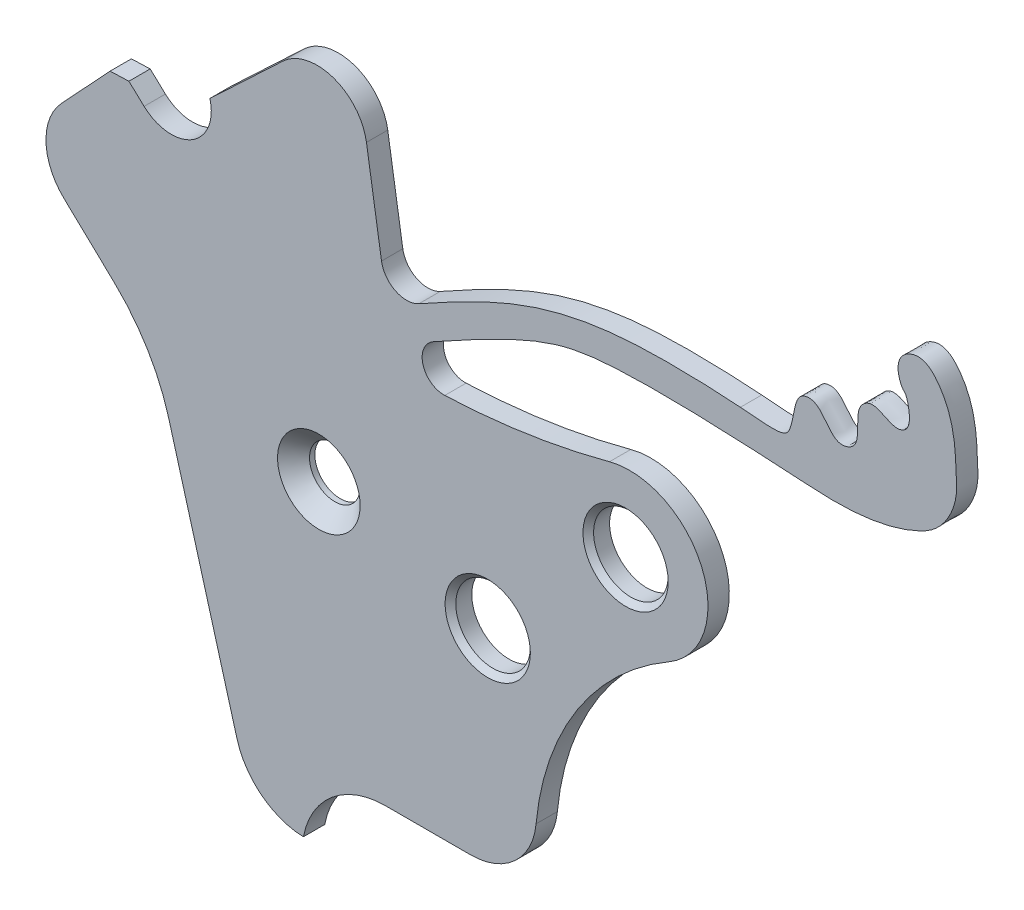
ISO-10303-21;
HEADER;
FILE_DESCRIPTION(('STEP AP214'),'2;1');
FILE_NAME('part.step','',(''),(''),'','','');
FILE_SCHEMA(('AUTOMOTIVE_DESIGN { 1 0 10303 214 1 1 1 1 }'));
ENDSEC;
DATA;
#1=APPLICATION_CONTEXT('core data for automotive mechanical design processes');
#2=APPLICATION_PROTOCOL_DEFINITION('international standard','automotive_design',2000,#1);
#3=PRODUCT_CONTEXT('',#1,'mechanical');
#4=PRODUCT('Part','Part','',(#3));
#5=PRODUCT_RELATED_PRODUCT_CATEGORY('part','',(#4));
#6=PRODUCT_DEFINITION_FORMATION('','',#4);
#7=PRODUCT_DEFINITION_CONTEXT('part definition',#1,'design');
#8=PRODUCT_DEFINITION('design','',#6,#7);
#9=PRODUCT_DEFINITION_SHAPE('','',#8);
#10=(LENGTH_UNIT() NAMED_UNIT(*) SI_UNIT(.MILLI.,.METRE.));
#11=(NAMED_UNIT(*) PLANE_ANGLE_UNIT() SI_UNIT($,.RADIAN.));
#12=(NAMED_UNIT(*) SI_UNIT($,.STERADIAN.) SOLID_ANGLE_UNIT());
#13=UNCERTAINTY_MEASURE_WITH_UNIT(LENGTH_MEASURE(1.E-05),#10,'distance_accuracy_value','');
#14=(GEOMETRIC_REPRESENTATION_CONTEXT(3) GLOBAL_UNCERTAINTY_ASSIGNED_CONTEXT((#13)) GLOBAL_UNIT_ASSIGNED_CONTEXT((#10,
#11,#12)) REPRESENTATION_CONTEXT('',''));
#15=CARTESIAN_POINT('',(0.,0.,0.));
#16=DIRECTION('',(0.,0.,1.));
#17=DIRECTION('',(1.,0.,0.));
#18=AXIS2_PLACEMENT_3D('',#15,#16,#17);
#19=CARTESIAN_POINT('',(-2.76936208659466,5.01169202146616,0.4));
#20=DIRECTION('',(0.,0.,-1.));
#21=DIRECTION('',(-1.,0.,0.));
#22=AXIS2_PLACEMENT_3D('',#19,#20,#21);
#23=CYLINDRICAL_SURFACE('',#22,0.750000000000002);
#24=CARTESIAN_POINT('',(-2.76936208659466,5.01169202146616,0.));
#25=DIRECTION('',(0.,0.,-1.));
#26=DIRECTION('',(1.,0.,0.));
#27=AXIS2_PLACEMENT_3D('',#24,#25,#26);
#28=CIRCLE('',#27,0.750000000000002);
#29=CARTESIAN_POINT('',(-2.04568324482414,5.20864108588045,0.));
#30=VERTEX_POINT('',#29);
#31=CARTESIAN_POINT('',(-3.28039810312994,4.46274558527792,0.));
#32=VERTEX_POINT('',#31);
#33=EDGE_CURVE('E223',#30,#32,#28,.T.);
#34=ORIENTED_EDGE('',*,*,#33,.T.);
#35=DIRECTION('',(0.,0.,-1.));
#36=VECTOR('',#35,1.);
#37=CARTESIAN_POINT('',(-3.28039810312994,4.46274558527792,0.4));
#38=LINE('',#37,#36);
#39=CARTESIAN_POINT('',(-3.28039810312994,4.46274558527792,0.4));
#40=VERTEX_POINT('',#39);
#41=EDGE_CURVE('E341',#40,#32,#38,.T.);
#42=ORIENTED_EDGE('',*,*,#41,.F.);
#43=CARTESIAN_POINT('',(-2.76936208659466,5.01169202146616,0.4));
#44=DIRECTION('',(0.,0.,-1.));
#45=DIRECTION('',(1.,0.,0.));
#46=AXIS2_PLACEMENT_3D('',#43,#44,#45);
#47=CIRCLE('',#46,0.750000000000002);
#48=CARTESIAN_POINT('',(-2.04568324482414,5.20864108588045,0.4));
#49=VERTEX_POINT('',#48);
#50=EDGE_CURVE('E283',#49,#40,#47,.T.);
#51=ORIENTED_EDGE('',*,*,#50,.F.);
#52=DIRECTION('',(0.,0.,-1.));
#53=VECTOR('',#52,1.);
#54=CARTESIAN_POINT('',(-2.04568324482414,5.20864108588045,0.4));
#55=LINE('',#54,#53);
#56=EDGE_CURVE('E219',#49,#30,#55,.T.);
#57=ORIENTED_EDGE('',*,*,#56,.T.);
#58=EDGE_LOOP('',(#34,#42,#51,#57));
#59=FACE_BOUND('',#58,.T.);
#60=ADVANCED_FACE('F35',(#59),#23,.F.);
#61=CARTESIAN_POINT('',(-3.28039810312994,4.46274558527792,0.4));
#62=DIRECTION('',(-0.681381355380353,-0.731928581584319,0.));
#63=DIRECTION('',(0.731928581584319,-0.681381355380353,0.));
#64=AXIS2_PLACEMENT_3D('',#61,#62,#63);
#65=PLANE('',#64);
#66=DIRECTION('',(-0.731928581584319,0.681381355380353,0.));
#67=VECTOR('',#66,1.);
#68=CARTESIAN_POINT('',(-3.28039810312994,4.46274558527792,0.));
#69=LINE('',#68,#67);
#70=CARTESIAN_POINT('',(-3.56599042337214,4.72861480687825,0.));
#71=VERTEX_POINT('',#70);
#72=EDGE_CURVE('E226',#32,#71,#69,.T.);
#73=ORIENTED_EDGE('',*,*,#72,.T.);
#74=DIRECTION('',(0.,0.,-1.));
#75=VECTOR('',#74,1.);
#76=CARTESIAN_POINT('',(-3.56599042337214,4.72861480687825,0.4));
#77=LINE('',#76,#75);
#78=CARTESIAN_POINT('',(-3.56599042337214,4.72861480687825,0.4));
#79=VERTEX_POINT('',#78);
#80=EDGE_CURVE('E338',#79,#71,#77,.T.);
#81=ORIENTED_EDGE('',*,*,#80,.F.);
#82=DIRECTION('',(-0.731928581584319,0.681381355380353,0.));
#83=VECTOR('',#82,1.);
#84=CARTESIAN_POINT('',(-3.28039810312994,4.46274558527792,0.4));
#85=LINE('',#84,#83);
#86=EDGE_CURVE('E141',#40,#79,#85,.T.);
#87=ORIENTED_EDGE('',*,*,#86,.F.);
#88=ORIENTED_EDGE('',*,*,#41,.T.);
#89=EDGE_LOOP('',(#73,#81,#87,#88));
#90=FACE_BOUND('',#89,.T.);
#91=ADVANCED_FACE('F487',(#90),#65,.F.);
#92=CARTESIAN_POINT('',(-3.56599042337214,4.72861480687825,0.4));
#93=DIRECTION('',(0.0357422864189901,-0.999361040346052,0.));
#94=DIRECTION('',(0.999361040346052,0.0357422864189901,0.));
#95=AXIS2_PLACEMENT_3D('',#92,#93,#94);
#96=PLANE('',#95);
#97=DIRECTION('',(-0.999361040346052,-0.0357422864189901,0.));
#98=VECTOR('',#97,1.);
#99=CARTESIAN_POINT('',(-3.56599042337214,4.72861480687825,0.));
#100=LINE('',#99,#98);
#101=CARTESIAN_POINT('',(-3.91931790761332,4.71597800032726,0.));
#102=VERTEX_POINT('',#101);
#103=EDGE_CURVE('E229',#71,#102,#100,.T.);
#104=ORIENTED_EDGE('',*,*,#103,.T.);
#105=DIRECTION('',(0.,0.,-1.));
#106=VECTOR('',#105,1.);
#107=CARTESIAN_POINT('',(-3.91931790761332,4.71597800032726,0.4));
#108=LINE('',#107,#106);
#109=CARTESIAN_POINT('',(-3.91931790761332,4.71597800032726,0.4));
#110=VERTEX_POINT('',#109);
#111=EDGE_CURVE('E335',#110,#102,#108,.T.);
#112=ORIENTED_EDGE('',*,*,#111,.F.);
#113=DIRECTION('',(-0.999361040346052,-0.0357422864189901,0.));
#114=VECTOR('',#113,1.);
#115=CARTESIAN_POINT('',(-3.56599042337214,4.72861480687825,0.4));
#116=LINE('',#115,#114);
#117=EDGE_CURVE('E383',#79,#110,#116,.T.);
#118=ORIENTED_EDGE('',*,*,#117,.F.);
#119=ORIENTED_EDGE('',*,*,#80,.T.);
#120=EDGE_LOOP('',(#104,#112,#118,#119));
#121=FACE_BOUND('',#120,.T.);
#122=ADVANCED_FACE('F483',(#121),#96,.F.);
#123=CARTESIAN_POINT('',(-3.91931790761332,4.71597800032726,0.4));
#124=DIRECTION('',(0.731928581584318,-0.681381355380354,0.));
#125=DIRECTION('',(0.681381355380354,0.731928581584318,0.));
#126=AXIS2_PLACEMENT_3D('',#123,#124,#125);
#127=PLANE('',#126);
#128=DIRECTION('',(-0.681381355380354,-0.731928581584318,0.));
#129=VECTOR('',#128,1.);
#130=CARTESIAN_POINT('',(-3.91931790761332,4.71597800032726,0.));
#131=LINE('',#130,#129);
#132=CARTESIAN_POINT('',(-4.83299202536779,3.73452437563124,0.));
#133=VERTEX_POINT('',#132);
#134=EDGE_CURVE('E231',#102,#133,#131,.T.);
#135=ORIENTED_EDGE('',*,*,#134,.T.);
#136=DIRECTION('',(0.,0.,-1.));
#137=VECTOR('',#136,1.);
#138=CARTESIAN_POINT('',(-4.83299202536779,3.73452437563124,0.4));
#139=LINE('',#138,#137);
#140=CARTESIAN_POINT('',(-4.83299202536779,3.73452437563124,0.4));
#141=VERTEX_POINT('',#140);
#142=EDGE_CURVE('E332',#141,#133,#139,.T.);
#143=ORIENTED_EDGE('',*,*,#142,.F.);
#144=DIRECTION('',(-0.681381355380354,-0.731928581584318,0.));
#145=VECTOR('',#144,1.);
#146=CARTESIAN_POINT('',(-3.91931790761332,4.71597800032726,0.4));
#147=LINE('',#146,#145);
#148=EDGE_CURVE('E385',#110,#141,#147,.T.);
#149=ORIENTED_EDGE('',*,*,#148,.F.);
#150=ORIENTED_EDGE('',*,*,#111,.T.);
#151=EDGE_LOOP('',(#135,#143,#149,#150));
#152=FACE_BOUND('',#151,.T.);
#153=ADVANCED_FACE('F479',(#152),#127,.F.);
#154=CARTESIAN_POINT('',(-4.04203815702774,2.99819403902067,0.4));
#155=DIRECTION('',(0.,0.,-1.));
#156=DIRECTION('',(-1.,0.,0.));
#157=AXIS2_PLACEMENT_3D('',#154,#155,#156);
#158=CYLINDRICAL_SURFACE('',#157,1.08064350572014);
#159=CARTESIAN_POINT('',(-4.04203815702774,2.99819403902067,0.));
#160=DIRECTION('',(0.,0.,1.));
#161=DIRECTION('',(1.,0.,0.));
#162=AXIS2_PLACEMENT_3D('',#159,#160,#161);
#163=CIRCLE('',#162,1.08064350572014);
#164=CARTESIAN_POINT('',(-4.78526095552171,2.21371315445183,0.));
#165=VERTEX_POINT('',#164);
#166=EDGE_CURVE('E233',#133,#165,#163,.T.);
#167=ORIENTED_EDGE('',*,*,#166,.T.);
#168=DIRECTION('',(0.,0.,-1.));
#169=VECTOR('',#168,1.);
#170=CARTESIAN_POINT('',(-4.78526095552171,2.21371315445183,0.4));
#171=LINE('',#170,#169);
#172=CARTESIAN_POINT('',(-4.78526095552171,2.21371315445183,0.4));
#173=VERTEX_POINT('',#172);
#174=EDGE_CURVE('E329',#173,#165,#171,.T.);
#175=ORIENTED_EDGE('',*,*,#174,.F.);
#176=CARTESIAN_POINT('',(-4.04203815702774,2.99819403902067,0.4));
#177=DIRECTION('',(0.,0.,1.));
#178=DIRECTION('',(1.,0.,0.));
#179=AXIS2_PLACEMENT_3D('',#176,#177,#178);
#180=CIRCLE('',#179,1.08064350572014);
#181=EDGE_CURVE('E387',#141,#173,#180,.T.);
#182=ORIENTED_EDGE('',*,*,#181,.F.);
#183=ORIENTED_EDGE('',*,*,#142,.T.);
#184=EDGE_LOOP('',(#167,#175,#182,#183));
#185=FACE_BOUND('',#184,.T.);
#186=ADVANCED_FACE('F475',(#185),#158,.T.);
#187=CARTESIAN_POINT('',(-4.78526095552171,2.21371315445183,0.4));
#188=DIRECTION('',(0.687759464208019,0.725938647126807,0.));
#189=DIRECTION('',(-0.725938647126807,0.687759464208019,0.));
#190=AXIS2_PLACEMENT_3D('',#187,#188,#189);
#191=PLANE('',#190);
#192=DIRECTION('',(0.725938647126807,-0.687759464208019,0.));
#193=VECTOR('',#192,1.);
#194=CARTESIAN_POINT('',(-4.78526095552171,2.21371315445183,0.));
#195=LINE('',#194,#193);
#196=CARTESIAN_POINT('',(-3.84267604720391,1.32070147353222,0.));
#197=VERTEX_POINT('',#196);
#198=EDGE_CURVE('E235',#165,#197,#195,.T.);
#199=ORIENTED_EDGE('',*,*,#198,.T.);
#200=DIRECTION('',(0.,0.,-1.));
#201=VECTOR('',#200,1.);
#202=CARTESIAN_POINT('',(-3.84267604720391,1.32070147353222,0.4));
#203=LINE('',#202,#201);
#204=CARTESIAN_POINT('',(-3.84267604720391,1.32070147353222,0.4));
#205=VERTEX_POINT('',#204);
#206=EDGE_CURVE('E326',#205,#197,#203,.T.);
#207=ORIENTED_EDGE('',*,*,#206,.F.);
#208=DIRECTION('',(0.725938647126807,-0.687759464208019,0.));
#209=VECTOR('',#208,1.);
#210=CARTESIAN_POINT('',(-4.78526095552171,2.21371315445183,0.4));
#211=LINE('',#210,#209);
#212=EDGE_CURVE('E389',#173,#205,#211,.T.);
#213=ORIENTED_EDGE('',*,*,#212,.F.);
#214=ORIENTED_EDGE('',*,*,#174,.T.);
#215=EDGE_LOOP('',(#199,#207,#213,#214));
#216=FACE_BOUND('',#215,.T.);
#217=ADVANCED_FACE('F471',(#216),#191,.F.);
#218=CARTESIAN_POINT('',(-6.40448637935346,-1.38332111503028,0.4));
#219=DIRECTION('',(0.,0.,-1.));
#220=DIRECTION('',(-1.,0.,0.));
#221=AXIS2_PLACEMENT_3D('',#218,#219,#220);
#222=CYLINDRICAL_SURFACE('',#221,3.72486380118313);
#223=CARTESIAN_POINT('',(-6.40448637935346,-1.38332111503028,0.));
#224=DIRECTION('',(0.,0.,-1.));
#225=DIRECTION('',(1.,0.,0.));
#226=AXIS2_PLACEMENT_3D('',#223,#224,#225);
#227=CIRCLE('',#226,3.72486380118313);
#228=CARTESIAN_POINT('',(-2.81799358326384,-0.377498187790231,0.));
#229=VERTEX_POINT('',#228);
#230=EDGE_CURVE('E237',#197,#229,#227,.T.);
#231=ORIENTED_EDGE('',*,*,#230,.T.);
#232=DIRECTION('',(0.,0.,-1.));
#233=VECTOR('',#232,1.);
#234=CARTESIAN_POINT('',(-2.81799358326384,-0.377498187790231,0.4));
#235=LINE('',#234,#233);
#236=CARTESIAN_POINT('',(-2.81799358326384,-0.377498187790231,0.4));
#237=VERTEX_POINT('',#236);
#238=EDGE_CURVE('E323',#237,#229,#235,.T.);
#239=ORIENTED_EDGE('',*,*,#238,.F.);
#240=CARTESIAN_POINT('',(-6.40448637935346,-1.38332111503028,0.4));
#241=DIRECTION('',(0.,0.,-1.));
#242=DIRECTION('',(1.,0.,0.));
#243=AXIS2_PLACEMENT_3D('',#240,#241,#242);
#244=CIRCLE('',#243,3.72486380118313);
#245=EDGE_CURVE('E391',#205,#237,#244,.T.);
#246=ORIENTED_EDGE('',*,*,#245,.F.);
#247=ORIENTED_EDGE('',*,*,#206,.T.);
#248=EDGE_LOOP('',(#231,#239,#246,#247));
#249=FACE_BOUND('',#248,.T.);
#250=ADVANCED_FACE('F467',(#249),#222,.F.);
#251=CARTESIAN_POINT('',(-2.81799358326384,-0.377498187790231,0.4));
#252=DIRECTION('',(0.962852063195019,0.270029450988399,0.));
#253=DIRECTION('',(-0.270029450988399,0.962852063195019,0.));
#254=AXIS2_PLACEMENT_3D('',#251,#252,#253);
#255=PLANE('',#254);
#256=DIRECTION('',(0.270029450988399,-0.962852063195019,0.));
#257=VECTOR('',#256,1.);
#258=CARTESIAN_POINT('',(-2.81799358326384,-0.377498187790231,0.));
#259=LINE('',#258,#257);
#260=CARTESIAN_POINT('',(-1.53754924027855,-4.94321675269871,0.));
#261=VERTEX_POINT('',#260);
#262=EDGE_CURVE('E239',#229,#261,#259,.T.);
#263=ORIENTED_EDGE('',*,*,#262,.T.);
#264=DIRECTION('',(0.,0.,-1.));
#265=VECTOR('',#264,1.);
#266=CARTESIAN_POINT('',(-1.53754924027855,-4.94321675269871,0.4));
#267=LINE('',#266,#265);
#268=CARTESIAN_POINT('',(-1.53754924027855,-4.94321675269871,0.4));
#269=VERTEX_POINT('',#268);
#270=EDGE_CURVE('E320',#269,#261,#267,.T.);
#271=ORIENTED_EDGE('',*,*,#270,.F.);
#272=DIRECTION('',(0.270029450988399,-0.962852063195019,0.));
#273=VECTOR('',#272,1.);
#274=CARTESIAN_POINT('',(-2.81799358326384,-0.377498187790231,0.4));
#275=LINE('',#274,#273);
#276=EDGE_CURVE('E393',#237,#269,#275,.T.);
#277=ORIENTED_EDGE('',*,*,#276,.F.);
#278=ORIENTED_EDGE('',*,*,#238,.T.);
#279=EDGE_LOOP('',(#263,#271,#277,#278));
#280=FACE_BOUND('',#279,.T.);
#281=ADVANCED_FACE('F463',(#280),#255,.F.);
#282=CARTESIAN_POINT('',(-0.250783482784262,-4.58234651693906,0.4));
#283=DIRECTION('',(0.,0.,-1.));
#284=DIRECTION('',(-1.,0.,0.));
#285=AXIS2_PLACEMENT_3D('',#282,#283,#284);
#286=CYLINDRICAL_SURFACE('',#285,1.33641065609231);
#287=CARTESIAN_POINT('',(-0.250783482784262,-4.58234651693906,0.));
#288=DIRECTION('',(0.,0.,1.));
#289=DIRECTION('',(1.,0.,0.));
#290=AXIS2_PLACEMENT_3D('',#287,#288,#289);
#291=CIRCLE('',#290,1.33641065609231);
#292=CARTESIAN_POINT('',(-0.28995093591259,-5.91818309090031,0.));
#293=VERTEX_POINT('',#292);
#294=EDGE_CURVE('E241',#261,#293,#291,.T.);
#295=ORIENTED_EDGE('',*,*,#294,.T.);
#296=DIRECTION('',(0.,0.,-1.));
#297=VECTOR('',#296,1.);
#298=CARTESIAN_POINT('',(-0.28995093591259,-5.91818309090031,0.4));
#299=LINE('',#298,#297);
#300=CARTESIAN_POINT('',(-0.28995093591259,-5.91818309090031,0.4));
#301=VERTEX_POINT('',#300);
#302=EDGE_CURVE('E317',#301,#293,#299,.T.);
#303=ORIENTED_EDGE('',*,*,#302,.F.);
#304=CARTESIAN_POINT('',(-0.250783482784262,-4.58234651693906,0.4));
#305=DIRECTION('',(0.,0.,1.));
#306=DIRECTION('',(1.,0.,0.));
#307=AXIS2_PLACEMENT_3D('',#304,#305,#306);
#308=CIRCLE('',#307,1.33641065609231);
#309=EDGE_CURVE('E395',#269,#301,#308,.T.);
#310=ORIENTED_EDGE('',*,*,#309,.F.);
#311=ORIENTED_EDGE('',*,*,#270,.T.);
#312=EDGE_LOOP('',(#295,#303,#310,#311));
#313=FACE_BOUND('',#312,.T.);
#314=ADVANCED_FACE('F459',(#313),#286,.T.);
#315=CARTESIAN_POINT('',(1.2530025444897,-6.21320548177053,0.4));
#316=DIRECTION('',(0.,0.,-1.));
#317=DIRECTION('',(-1.,0.,0.));
#318=AXIS2_PLACEMENT_3D('',#315,#316,#317);
#319=CYLINDRICAL_SURFACE('',#318,1.57090536118518);
#320=CARTESIAN_POINT('',(1.2530025444897,-6.21320548177053,0.));
#321=DIRECTION('',(0.,0.,-1.));
#322=DIRECTION('',(1.,0.,0.));
#323=AXIS2_PLACEMENT_3D('',#320,#321,#322);
#324=CIRCLE('',#323,1.57090536118518);
#325=CARTESIAN_POINT('',(1.25300254448973,-4.64230012058535,0.));
#326=VERTEX_POINT('',#325);
#327=EDGE_CURVE('E243',#293,#326,#324,.T.);
#328=ORIENTED_EDGE('',*,*,#327,.T.);
#329=DIRECTION('',(0.,0.,-1.));
#330=VECTOR('',#329,1.);
#331=CARTESIAN_POINT('',(1.25300254448973,-4.64230012058535,0.4));
#332=LINE('',#331,#330);
#333=CARTESIAN_POINT('',(1.25300254448973,-4.64230012058535,0.4));
#334=VERTEX_POINT('',#333);
#335=EDGE_CURVE('E314',#334,#326,#332,.T.);
#336=ORIENTED_EDGE('',*,*,#335,.F.);
#337=CARTESIAN_POINT('',(1.2530025444897,-6.21320548177053,0.4));
#338=DIRECTION('',(0.,0.,-1.));
#339=DIRECTION('',(1.,0.,0.));
#340=AXIS2_PLACEMENT_3D('',#337,#338,#339);
#341=CIRCLE('',#340,1.57090536118518);
#342=EDGE_CURVE('E397',#301,#334,#341,.T.);
#343=ORIENTED_EDGE('',*,*,#342,.F.);
#344=ORIENTED_EDGE('',*,*,#302,.T.);
#345=EDGE_LOOP('',(#328,#336,#343,#344));
#346=FACE_BOUND('',#345,.T.);
#347=ADVANCED_FACE('F455',(#346),#319,.F.);
#348=CARTESIAN_POINT('',(1.25300254448973,-4.64230012058535,0.4));
#349=DIRECTION('',(0.,1.,0.));
#350=DIRECTION('',(-1.,0.,0.));
#351=AXIS2_PLACEMENT_3D('',#348,#349,#350);
#352=PLANE('',#351);
#353=DIRECTION('',(1.,0.,0.));
#354=VECTOR('',#353,1.);
#355=CARTESIAN_POINT('',(1.25300254448973,-4.64230012058535,0.));
#356=LINE('',#355,#354);
#357=CARTESIAN_POINT('',(2.84908792651946,-4.64230012058541,0.));
#358=VERTEX_POINT('',#357);
#359=EDGE_CURVE('E245',#326,#358,#356,.T.);
#360=ORIENTED_EDGE('',*,*,#359,.T.);
#361=DIRECTION('',(0.,0.,-1.));
#362=VECTOR('',#361,1.);
#363=CARTESIAN_POINT('',(2.84908792651946,-4.64230012058541,0.4));
#364=LINE('',#363,#362);
#365=CARTESIAN_POINT('',(2.84908792651946,-4.64230012058541,0.4));
#366=VERTEX_POINT('',#365);
#367=EDGE_CURVE('E311',#366,#358,#364,.T.);
#368=ORIENTED_EDGE('',*,*,#367,.F.);
#369=DIRECTION('',(1.,0.,0.));
#370=VECTOR('',#369,1.);
#371=CARTESIAN_POINT('',(1.25300254448973,-4.64230012058535,0.4));
#372=LINE('',#371,#370);
#373=EDGE_CURVE('E399',#334,#366,#372,.T.);
#374=ORIENTED_EDGE('',*,*,#373,.F.);
#375=ORIENTED_EDGE('',*,*,#335,.T.);
#376=EDGE_LOOP('',(#360,#368,#374,#375));
#377=FACE_BOUND('',#376,.T.);
#378=ADVANCED_FACE('F451',(#377),#352,.F.);
#379=CARTESIAN_POINT('',(2.84908792651951,-3.40803626192057,0.4));
#380=DIRECTION('',(0.,0.,-1.));
#381=DIRECTION('',(-1.,0.,0.));
#382=AXIS2_PLACEMENT_3D('',#379,#380,#381);
#383=CYLINDRICAL_SURFACE('',#382,1.23426385866484);
#384=CARTESIAN_POINT('',(2.84908792651951,-3.40803626192057,0.));
#385=DIRECTION('',(0.,0.,1.));
#386=DIRECTION('',(1.,0.,0.));
#387=AXIS2_PLACEMENT_3D('',#384,#385,#386);
#388=CIRCLE('',#387,1.23426385866484);
#389=CARTESIAN_POINT('',(4.07789932433615,-3.52392336820142,0.));
#390=VERTEX_POINT('',#389);
#391=EDGE_CURVE('E247',#358,#390,#388,.T.);
#392=ORIENTED_EDGE('',*,*,#391,.T.);
#393=DIRECTION('',(0.,0.,-1.));
#394=VECTOR('',#393,1.);
#395=CARTESIAN_POINT('',(4.07789932433615,-3.52392336820142,0.4));
#396=LINE('',#395,#394);
#397=CARTESIAN_POINT('',(4.07789932433615,-3.52392336820142,0.4));
#398=VERTEX_POINT('',#397);
#399=EDGE_CURVE('E308',#398,#390,#396,.T.);
#400=ORIENTED_EDGE('',*,*,#399,.F.);
#401=CARTESIAN_POINT('',(2.84908792651951,-3.40803626192057,0.4));
#402=DIRECTION('',(0.,0.,1.));
#403=DIRECTION('',(1.,0.,0.));
#404=AXIS2_PLACEMENT_3D('',#401,#402,#403);
#405=CIRCLE('',#404,1.23426385866484);
#406=EDGE_CURVE('E401',#366,#398,#405,.T.);
#407=ORIENTED_EDGE('',*,*,#406,.F.);
#408=ORIENTED_EDGE('',*,*,#367,.T.);
#409=EDGE_LOOP('',(#392,#400,#407,#408));
#410=FACE_BOUND('',#409,.T.);
#411=ADVANCED_FACE('F447',(#410),#383,.T.);
#412=CARTESIAN_POINT('',(9.08084204789286,-3.99574236023802,0.4));
#413=DIRECTION('',(0.,0.,-1.));
#414=DIRECTION('',(-1.,0.,0.));
#415=AXIS2_PLACEMENT_3D('',#412,#413,#414);
#416=CYLINDRICAL_SURFACE('',#415,5.02514169515994);
#417=CARTESIAN_POINT('',(9.08084204789286,-3.99574236023802,0.));
#418=DIRECTION('',(0.,0.,-1.));
#419=DIRECTION('',(1.,0.,0.));
#420=AXIS2_PLACEMENT_3D('',#417,#418,#419);
#421=CIRCLE('',#420,5.02514169515994);
#422=CARTESIAN_POINT('',(6.56980839621668,0.357045143946472,0.));
#423=VERTEX_POINT('',#422);
#424=EDGE_CURVE('E249',#390,#423,#421,.T.);
#425=ORIENTED_EDGE('',*,*,#424,.T.);
#426=DIRECTION('',(0.,0.,-1.));
#427=VECTOR('',#426,1.);
#428=CARTESIAN_POINT('',(6.56980839621668,0.357045143946472,0.4));
#429=LINE('',#428,#427);
#430=CARTESIAN_POINT('',(6.56980839621668,0.357045143946472,0.4));
#431=VERTEX_POINT('',#430);
#432=EDGE_CURVE('E305',#431,#423,#429,.T.);
#433=ORIENTED_EDGE('',*,*,#432,.F.);
#434=CARTESIAN_POINT('',(9.08084204789286,-3.99574236023802,0.4));
#435=DIRECTION('',(0.,0.,-1.));
#436=DIRECTION('',(1.,0.,0.));
#437=AXIS2_PLACEMENT_3D('',#434,#435,#436);
#438=CIRCLE('',#437,5.02514169515994);
#439=EDGE_CURVE('E403',#398,#431,#438,.T.);
#440=ORIENTED_EDGE('',*,*,#439,.F.);
#441=ORIENTED_EDGE('',*,*,#399,.T.);
#442=EDGE_LOOP('',(#425,#433,#440,#441));
#443=FACE_BOUND('',#442,.T.);
#444=ADVANCED_FACE('F443',(#443),#416,.F.);
#445=CARTESIAN_POINT('',(5.83473865421867,1.63126239130903,0.4));
#446=DIRECTION('',(0.,0.,-1.));
#447=DIRECTION('',(-1.,0.,0.));
#448=AXIS2_PLACEMENT_3D('',#445,#446,#447);
#449=CYLINDRICAL_SURFACE('',#448,1.47103946890569);
#450=CARTESIAN_POINT('',(5.83473865421867,1.63126239130903,0.));
#451=DIRECTION('',(0.,0.,1.));
#452=DIRECTION('',(1.,0.,0.));
#453=AXIS2_PLACEMENT_3D('',#450,#451,#452);
#454=CIRCLE('',#453,1.47103946890569);
#455=CARTESIAN_POINT('',(5.45551581171538,3.05258119960014,0.));
#456=VERTEX_POINT('',#455);
#457=EDGE_CURVE('E251',#423,#456,#454,.T.);
#458=ORIENTED_EDGE('',*,*,#457,.T.);
#459=DIRECTION('',(0.,0.,-1.));
#460=VECTOR('',#459,1.);
#461=CARTESIAN_POINT('',(5.45551581171538,3.05258119960014,0.4));
#462=LINE('',#461,#460);
#463=CARTESIAN_POINT('',(5.45551581171538,3.05258119960014,0.4));
#464=VERTEX_POINT('',#463);
#465=EDGE_CURVE('E302',#464,#456,#462,.T.);
#466=ORIENTED_EDGE('',*,*,#465,.F.);
#467=CARTESIAN_POINT('',(5.83473865421867,1.63126239130903,0.4));
#468=DIRECTION('',(0.,0.,1.));
#469=DIRECTION('',(1.,0.,0.));
#470=AXIS2_PLACEMENT_3D('',#467,#468,#469);
#471=CIRCLE('',#470,1.47103946890569);
#472=EDGE_CURVE('E405',#431,#464,#471,.T.);
#473=ORIENTED_EDGE('',*,*,#472,.F.);
#474=ORIENTED_EDGE('',*,*,#432,.T.);
#475=EDGE_LOOP('',(#458,#466,#473,#474));
#476=FACE_BOUND('',#475,.T.);
#477=ADVANCED_FACE('F439',(#476),#449,.T.);
#478=CARTESIAN_POINT('',(1.80355855747355,16.7400360432615,0.4));
#479=DIRECTION('',(0.,0.,-1.));
#480=DIRECTION('',(-1.,0.,0.));
#481=AXIS2_PLACEMENT_3D('',#478,#479,#480);
#482=CYLINDRICAL_SURFACE('',#481,14.1662702178117);
#483=CARTESIAN_POINT('',(1.80355855747355,16.7400360432615,0.));
#484=DIRECTION('',(0.,0.,-1.));
#485=DIRECTION('',(1.,0.,0.));
#486=AXIS2_PLACEMENT_3D('',#483,#484,#485);
#487=CIRCLE('',#486,14.1662702178117);
#488=CARTESIAN_POINT('',(2.36430100162529,2.58486808963455,0.));
#489=VERTEX_POINT('',#488);
#490=EDGE_CURVE('E253',#456,#489,#487,.T.);
#491=ORIENTED_EDGE('',*,*,#490,.T.);
#492=DIRECTION('',(0.,0.,-1.));
#493=VECTOR('',#492,1.);
#494=CARTESIAN_POINT('',(2.36430100162529,2.58486808963455,0.4));
#495=LINE('',#494,#493);
#496=CARTESIAN_POINT('',(2.36430100162529,2.58486808963455,0.4));
#497=VERTEX_POINT('',#496);
#498=EDGE_CURVE('E299',#497,#489,#495,.T.);
#499=ORIENTED_EDGE('',*,*,#498,.F.);
#500=CARTESIAN_POINT('',(1.80355855747355,16.7400360432615,0.4));
#501=DIRECTION('',(0.,0.,-1.));
#502=DIRECTION('',(1.,0.,0.));
#503=AXIS2_PLACEMENT_3D('',#500,#501,#502);
#504=CIRCLE('',#503,14.1662702178117);
#505=EDGE_CURVE('E407',#464,#497,#504,.T.);
#506=ORIENTED_EDGE('',*,*,#505,.F.);
#507=ORIENTED_EDGE('',*,*,#465,.T.);
#508=EDGE_LOOP('',(#491,#499,#506,#507));
#509=FACE_BOUND('',#508,.T.);
#510=ADVANCED_FACE('F435',(#509),#482,.F.);
#511=CARTESIAN_POINT('',(2.34810763933173,2.99364713853625,0.4));
#512=DIRECTION('',(0.,0.,-1.));
#513=DIRECTION('',(-1.,0.,0.));
#514=AXIS2_PLACEMENT_3D('',#511,#512,#513);
#515=CYLINDRICAL_SURFACE('',#514,0.409099664878175);
#516=CARTESIAN_POINT('',(2.34810763933173,2.99364713853625,0.));
#517=DIRECTION('',(0.,0.,-1.));
#518=DIRECTION('',(1.,0.,0.));
#519=AXIS2_PLACEMENT_3D('',#516,#517,#518);
#520=CIRCLE('',#519,0.409099664878175);
#521=CARTESIAN_POINT('',(2.14894489172161,3.35099393895263,0.));
#522=VERTEX_POINT('',#521);
#523=EDGE_CURVE('E255',#489,#522,#520,.T.);
#524=ORIENTED_EDGE('',*,*,#523,.T.);
#525=DIRECTION('',(0.,0.,-1.));
#526=VECTOR('',#525,1.);
#527=CARTESIAN_POINT('',(2.14894489172161,3.35099393895263,0.4));
#528=LINE('',#527,#526);
#529=CARTESIAN_POINT('',(2.14894489172161,3.35099393895263,0.4));
#530=VERTEX_POINT('',#529);
#531=EDGE_CURVE('E296',#530,#522,#528,.T.);
#532=ORIENTED_EDGE('',*,*,#531,.F.);
#533=CARTESIAN_POINT('',(2.34810763933173,2.99364713853625,0.4));
#534=DIRECTION('',(0.,0.,-1.));
#535=DIRECTION('',(1.,0.,0.));
#536=AXIS2_PLACEMENT_3D('',#533,#534,#535);
#537=CIRCLE('',#536,0.409099664878175);
#538=EDGE_CURVE('E409',#497,#530,#537,.T.);
#539=ORIENTED_EDGE('',*,*,#538,.F.);
#540=ORIENTED_EDGE('',*,*,#498,.T.);
#541=EDGE_LOOP('',(#524,#532,#539,#540));
#542=FACE_BOUND('',#541,.T.);
#543=ADVANCED_FACE('F430',(#542),#515,.F.);
#544=CARTESIAN_POINT('',(2.14894489172183,3.35099393895223,0.4));
#545=CARTESIAN_POINT('',(3.99078473340218,4.37752022406124,0.4));
#546=CARTESIAN_POINT('',(5.05457006131993,4.74980278319915,0.4));
#547=CARTESIAN_POINT('',(8.07736742960842,4.61097896332243,0.4));
#548=CARTESIAN_POINT('',(9.97476132215171,4.48763315673252,0.4));
#549=CARTESIAN_POINT('',(10.8761480089557,4.61283658120546,0.4));
#550=CARTESIAN_POINT('',(11.7359023371807,5.08245639825246,0.4));
#551=CARTESIAN_POINT('',(12.006850801545,5.63003633086319,0.4));
#552=CARTESIAN_POINT('',(11.9646132336516,6.08863542616569,0.4));
#553=CARTESIAN_POINT('',(11.9479086803603,6.58278851942293,0.4));
#554=CARTESIAN_POINT('',(11.8730434398749,7.16993360392496,0.4));
#555=CARTESIAN_POINT('',(11.4017299554641,7.69848692638836,0.4));
#556=CARTESIAN_POINT('',(11.1183681225673,7.64198969610429,0.4));
#557=CARTESIAN_POINT('',(10.7541151126799,7.43305771672136,0.4));
#558=CARTESIAN_POINT('',(10.9074582451397,7.04579173436492,0.4));
#559=CARTESIAN_POINT('',(10.9760671163839,6.97547081798556,0.4));
#560=B_SPLINE_CURVE_WITH_KNOTS('',3,(#544,#545,#546,#547,#548,#549,#550,#551,#552,#553,#554,
#555,#556,#557,#558,#559),.UNSPECIFIED.,.F.,.F.,(4,1,1,1,1,1,1,1,1,1,1,1,1,4),(0.,
0.257493957164509,0.509771917898286,0.556127037667663,0.672708129633453,0.696759207045186,
0.7661099286382,0.785364363796559,0.796025603088212,0.872722321554735,0.911006436131368,
0.922367481464991,0.931266837851854,1.),.UNSPECIFIED.);
#561=DIRECTION('',(0.,0.,-1.));
#562=VECTOR('',#561,1.);
#563=SURFACE_OF_LINEAR_EXTRUSION('',#560,#562);
#564=CARTESIAN_POINT('',(2.14894489172183,3.35099393895223,0.));
#565=CARTESIAN_POINT('',(3.99078473340218,4.37752022406124,0.));
#566=CARTESIAN_POINT('',(5.05457006131993,4.74980278319915,0.));
#567=CARTESIAN_POINT('',(8.07736742960842,4.61097896332243,0.));
#568=CARTESIAN_POINT('',(9.97476132215171,4.48763315673252,0.));
#569=CARTESIAN_POINT('',(10.8761480089557,4.61283658120546,0.));
#570=CARTESIAN_POINT('',(11.7359023371807,5.08245639825246,0.));
#571=CARTESIAN_POINT('',(12.006850801545,5.63003633086319,0.));
#572=CARTESIAN_POINT('',(11.9646132336516,6.08863542616569,0.));
#573=CARTESIAN_POINT('',(11.9479086803603,6.58278851942293,0.));
#574=CARTESIAN_POINT('',(11.8730434398749,7.16993360392496,0.));
#575=CARTESIAN_POINT('',(11.4017299554641,7.69848692638836,0.));
#576=CARTESIAN_POINT('',(11.1183681225673,7.64198969610429,0.));
#577=CARTESIAN_POINT('',(10.7541151126799,7.43305771672136,0.));
#578=CARTESIAN_POINT('',(10.9074582451397,7.04579173436492,0.));
#579=CARTESIAN_POINT('',(10.9760671163839,6.97547081798556,0.));
#580=B_SPLINE_CURVE_WITH_KNOTS('',3,(#564,#565,#566,#567,#568,#569,#570,#571,#572,#573,#574,
#575,#576,#577,#578,#579),.UNSPECIFIED.,.F.,.F.,(4,1,1,1,1,1,1,1,1,1,1,1,1,4),(0.,
0.257493957164509,0.509771917898286,0.556127037667663,0.672708129633453,0.696759207045186,
0.7661099286382,0.785364363796559,0.796025603088212,0.872722321554735,0.911006436131368,
0.922367481464991,0.931266837851854,1.),.UNSPECIFIED.);
#581=CARTESIAN_POINT('',(10.9760671163839,6.97547081798556,0.));
#582=VERTEX_POINT('',#581);
#583=EDGE_CURVE('E257',#522,#582,#580,.T.);
#584=ORIENTED_EDGE('',*,*,#583,.T.);
#585=DIRECTION('',(0.,0.,-1.));
#586=VECTOR('',#585,1.);
#587=CARTESIAN_POINT('',(10.9760671163839,6.97547081798556,0.4));
#588=LINE('',#587,#586);
#589=CARTESIAN_POINT('',(10.9760671163839,6.97547081798556,0.4));
#590=VERTEX_POINT('',#589);
#591=EDGE_CURVE('E293',#590,#582,#588,.T.);
#592=ORIENTED_EDGE('',*,*,#591,.F.);
#593=EDGE_CURVE('E411',#530,#590,#560,.T.);
#594=ORIENTED_EDGE('',*,*,#593,.F.);
#595=ORIENTED_EDGE('',*,*,#531,.T.);
#596=EDGE_LOOP('',(#584,#592,#594,#595));
#597=FACE_BOUND('',#596,.T.);
#598=ADVANCED_FACE('F425',(#597),#563,.F.);
#599=CARTESIAN_POINT('',(10.9760671163839,6.97547081798556,0.4));
#600=CARTESIAN_POINT('',(11.0072302133545,6.94353008646708,0.4));
#601=CARTESIAN_POINT('',(11.0309980526381,6.92705436545979,0.4));
#602=CARTESIAN_POINT('',(11.1835438576118,6.43658221603922,0.4));
#603=CARTESIAN_POINT('',(10.7681319072389,6.21076616566619,0.4));
#604=CARTESIAN_POINT('',(10.4744115703398,6.54656668538427,0.4));
#605=CARTESIAN_POINT('',(9.98582530491332,6.23725312333004,0.4));
#606=CARTESIAN_POINT('',(10.2614077539824,5.63356726979391,0.4));
#607=CARTESIAN_POINT('',(9.60106409321319,5.41676882258355,0.4));
#608=CARTESIAN_POINT('',(9.4619500549889,5.99879585028782,0.4));
#609=CARTESIAN_POINT('',(8.95394346419713,5.94190839573758,0.4));
#610=CARTESIAN_POINT('',(8.93300998360141,5.61588283915317,0.4));
#611=CARTESIAN_POINT('',(8.80401396920744,5.09991773284132,0.4));
#612=CARTESIAN_POINT('',(8.76649674609932,5.09184947234198,0.4));
#613=CARTESIAN_POINT('',(7.91380776710667,5.16707222740598,0.4));
#614=B_SPLINE_CURVE_WITH_KNOTS('',3,(#599,#600,#601,#602,#603,#604,#605,#606,#607,#608,#609,
#610,#611,#612,#613),.UNSPECIFIED.,.F.,.F.,(4,1,1,1,1,1,1,1,1,1,1,1,4),(0.,0.0104512169861752,
0.122621216139973,0.153759130194453,0.268566733683714,0.304390747041119,0.463925269094616,
0.508355610390277,0.652283215389602,0.681879220850212,0.784525671451849,0.800049609032826,1.),.UNSPECIFIED.);
#615=DIRECTION('',(0.,0.,-1.));
#616=VECTOR('',#615,1.);
#617=SURFACE_OF_LINEAR_EXTRUSION('',#614,#616);
#618=CARTESIAN_POINT('',(10.9760671163839,6.97547081798556,0.));
#619=CARTESIAN_POINT('',(11.0072302133545,6.94353008646708,0.));
#620=CARTESIAN_POINT('',(11.0309980526381,6.92705436545979,0.));
#621=CARTESIAN_POINT('',(11.1835438576118,6.43658221603922,0.));
#622=CARTESIAN_POINT('',(10.7681319072389,6.21076616566619,0.));
#623=CARTESIAN_POINT('',(10.4744115703398,6.54656668538427,0.));
#624=CARTESIAN_POINT('',(9.98582530491332,6.23725312333004,0.));
#625=CARTESIAN_POINT('',(10.2614077539824,5.63356726979391,0.));
#626=CARTESIAN_POINT('',(9.60106409321319,5.41676882258355,0.));
#627=CARTESIAN_POINT('',(9.4619500549889,5.99879585028782,0.));
#628=CARTESIAN_POINT('',(8.95394346419713,5.94190839573758,0.));
#629=CARTESIAN_POINT('',(8.93300998360141,5.61588283915317,0.));
#630=CARTESIAN_POINT('',(8.80401396920744,5.09991773284132,0.));
#631=CARTESIAN_POINT('',(8.76649674609932,5.09184947234198,0.));
#632=CARTESIAN_POINT('',(7.91380776710667,5.16707222740598,0.));
#633=B_SPLINE_CURVE_WITH_KNOTS('',3,(#618,#619,#620,#621,#622,#623,#624,#625,#626,#627,#628,
#629,#630,#631,#632),.UNSPECIFIED.,.F.,.F.,(4,1,1,1,1,1,1,1,1,1,1,1,4),(0.,0.0104512169861752,
0.122621216139973,0.153759130194453,0.268566733683714,0.304390747041119,0.463925269094616,
0.508355610390277,0.652283215389602,0.681879220850212,0.784525671451849,0.800049609032826,1.),.UNSPECIFIED.);
#634=CARTESIAN_POINT('',(7.91380776710667,5.16707222740598,0.));
#635=VERTEX_POINT('',#634);
#636=EDGE_CURVE('E261',#582,#635,#633,.T.);
#637=ORIENTED_EDGE('',*,*,#636,.T.);
#638=DIRECTION('',(0.,0.,-1.));
#639=VECTOR('',#638,1.);
#640=CARTESIAN_POINT('',(7.91380776710667,5.16707222740598,0.4));
#641=LINE('',#640,#639);
#642=CARTESIAN_POINT('',(7.91380776710667,5.16707222740598,0.4));
#643=VERTEX_POINT('',#642);
#644=EDGE_CURVE('E290',#643,#635,#641,.T.);
#645=ORIENTED_EDGE('',*,*,#644,.F.);
#646=EDGE_CURVE('E416',#590,#643,#614,.T.);
#647=ORIENTED_EDGE('',*,*,#646,.F.);
#648=ORIENTED_EDGE('',*,*,#591,.T.);
#649=EDGE_LOOP('',(#637,#645,#647,#648));
#650=FACE_BOUND('',#649,.T.);
#651=ADVANCED_FACE('F429',(#650),#617,.F.);
#652=CARTESIAN_POINT('',(7.91380776710667,5.16707222740598,0.4));
#653=CARTESIAN_POINT('',(7.6138070836084,5.19353777168977,0.4));
#654=CARTESIAN_POINT('',(4.77910224743802,5.338097214629,0.4));
#655=CARTESIAN_POINT('',(3.36154801255398,4.65983176462139,0.4));
#656=CARTESIAN_POINT('',(1.87976076256279,3.83397626587889,0.4));
#657=B_SPLINE_CURVE_WITH_KNOTS('',3,(#652,#653,#654,#655,#656),.UNSPECIFIED.,.F.,.F.,(4,1,4),
(0.,0.292258710243787,1.),.UNSPECIFIED.);
#658=DIRECTION('',(0.,0.,-1.));
#659=VECTOR('',#658,1.);
#660=SURFACE_OF_LINEAR_EXTRUSION('',#657,#659);
#661=CARTESIAN_POINT('',(7.91380776710667,5.16707222740598,0.));
#662=CARTESIAN_POINT('',(7.6138070836084,5.19353777168977,0.));
#663=CARTESIAN_POINT('',(4.77910224743802,5.338097214629,0.));
#664=CARTESIAN_POINT('',(3.36154801255398,4.65983176462139,0.));
#665=CARTESIAN_POINT('',(1.87976076256279,3.83397626587889,0.));
#666=B_SPLINE_CURVE_WITH_KNOTS('',3,(#661,#662,#663,#664,#665),.UNSPECIFIED.,.F.,.F.,(4,1,4),
(0.,0.292258710243787,1.),.UNSPECIFIED.);
#667=CARTESIAN_POINT('',(1.87976076256279,3.83397626587889,0.));
#668=VERTEX_POINT('',#667);
#669=EDGE_CURVE('E268',#635,#668,#666,.T.);
#670=ORIENTED_EDGE('',*,*,#669,.T.);
#671=DIRECTION('',(0.,0.,-1.));
#672=VECTOR('',#671,1.);
#673=CARTESIAN_POINT('',(1.87976076256279,3.83397626587889,0.4));
#674=LINE('',#673,#672);
#675=CARTESIAN_POINT('',(1.87976076256279,3.83397626587889,0.4));
#676=VERTEX_POINT('',#675);
#677=EDGE_CURVE('E287',#676,#668,#674,.T.);
#678=ORIENTED_EDGE('',*,*,#677,.F.);
#679=EDGE_CURVE('E536',#643,#676,#657,.T.);
#680=ORIENTED_EDGE('',*,*,#679,.F.);
#681=ORIENTED_EDGE('',*,*,#644,.T.);
#682=EDGE_LOOP('',(#670,#678,#680,#681));
#683=FACE_BOUND('',#682,.T.);
#684=ADVANCED_FACE('F532',(#683),#660,.F.);
#685=CARTESIAN_POINT('',(1.64756818738585,4.2505866752831,0.4));
#686=DIRECTION('',(0.,0.,-1.));
#687=DIRECTION('',(-1.,0.,0.));
#688=AXIS2_PLACEMENT_3D('',#685,#686,#687);
#689=CYLINDRICAL_SURFACE('',#688,0.476946144958998);
#690=CARTESIAN_POINT('',(1.64756818738585,4.2505866752831,0.));
#691=DIRECTION('',(0.,0.,-1.));
#692=DIRECTION('',(1.,0.,0.));
#693=AXIS2_PLACEMENT_3D('',#690,#691,#692);
#694=CIRCLE('',#693,0.476946144958998);
#695=CARTESIAN_POINT('',(1.17647393635057,4.17610290636156,0.));
#696=VERTEX_POINT('',#695);
#697=EDGE_CURVE('E275',#668,#696,#694,.T.);
#698=ORIENTED_EDGE('',*,*,#697,.T.);
#699=DIRECTION('',(0.,0.,-1.));
#700=VECTOR('',#699,1.);
#701=CARTESIAN_POINT('',(1.17647393635057,4.17610290636156,0.4));
#702=LINE('',#701,#700);
#703=CARTESIAN_POINT('',(1.17647393635057,4.17610290636156,0.4));
#704=VERTEX_POINT('',#703);
#705=EDGE_CURVE('E214',#704,#696,#702,.T.);
#706=ORIENTED_EDGE('',*,*,#705,.F.);
#707=CARTESIAN_POINT('',(1.64756818738585,4.2505866752831,0.4));
#708=DIRECTION('',(0.,0.,-1.));
#709=DIRECTION('',(1.,0.,0.));
#710=AXIS2_PLACEMENT_3D('',#707,#708,#709);
#711=CIRCLE('',#710,0.476946144958998);
#712=EDGE_CURVE('E205',#676,#704,#711,.T.);
#713=ORIENTED_EDGE('',*,*,#712,.F.);
#714=ORIENTED_EDGE('',*,*,#677,.T.);
#715=EDGE_LOOP('',(#698,#706,#713,#714));
#716=FACE_BOUND('',#715,.T.);
#717=ADVANCED_FACE('F530',(#716),#689,.F.);
#718=CARTESIAN_POINT('',(1.17647393635057,4.17610290636156,0.4));
#719=DIRECTION('',(-0.987730493294542,-0.156168090902464,0.));
#720=DIRECTION('',(0.156168090902464,-0.987730493294542,0.));
#721=AXIS2_PLACEMENT_3D('',#718,#719,#720);
#722=PLANE('',#721);
#723=DIRECTION('',(-0.156168090902464,0.987730493294542,0.));
#724=VECTOR('',#723,1.);
#725=CARTESIAN_POINT('',(1.17647393635057,4.17610290636156,0.));
#726=LINE('',#725,#724);
#727=CARTESIAN_POINT('',(0.893773185906562,5.96412599146919,0.));
#728=VERTEX_POINT('',#727);
#729=EDGE_CURVE('E213',#696,#728,#726,.T.);
#730=ORIENTED_EDGE('',*,*,#729,.T.);
#731=DIRECTION('',(0.,0.,-1.));
#732=VECTOR('',#731,1.);
#733=CARTESIAN_POINT('',(0.893773185906562,5.96412599146919,0.4));
#734=LINE('',#733,#732);
#735=CARTESIAN_POINT('',(0.893773185906562,5.96412599146919,0.4));
#736=VERTEX_POINT('',#735);
#737=EDGE_CURVE('E210',#736,#728,#734,.T.);
#738=ORIENTED_EDGE('',*,*,#737,.F.);
#739=DIRECTION('',(-0.156168090902464,0.987730493294542,0.));
#740=VECTOR('',#739,1.);
#741=CARTESIAN_POINT('',(1.17647393635057,4.17610290636156,0.4));
#742=LINE('',#741,#740);
#743=EDGE_CURVE('E199',#704,#736,#742,.T.);
#744=ORIENTED_EDGE('',*,*,#743,.F.);
#745=ORIENTED_EDGE('',*,*,#705,.T.);
#746=EDGE_LOOP('',(#730,#738,#744,#745));
#747=FACE_BOUND('',#746,.T.);
#748=ADVANCED_FACE('F211',(#747),#722,.F.);
#749=CARTESIAN_POINT('',(-0.0324013557007233,5.81769038885573,0.4));
#750=DIRECTION('',(0.,0.,-1.));
#751=DIRECTION('',(-1.,0.,0.));
#752=AXIS2_PLACEMENT_3D('',#749,#750,#751);
#753=CYLINDRICAL_SURFACE('',#752,0.937679405358907);
#754=CARTESIAN_POINT('',(-0.0324013557007233,5.81769038885573,0.));
#755=DIRECTION('',(0.,0.,1.));
#756=DIRECTION('',(1.,0.,0.));
#757=AXIS2_PLACEMENT_3D('',#754,#755,#756);
#758=CIRCLE('',#757,0.937679405358907);
#759=CARTESIAN_POINT('',(-0.67554550606707,6.50004533247656,0.));
#760=VERTEX_POINT('',#759);
#761=EDGE_CURVE('E126',#728,#760,#758,.T.);
#762=ORIENTED_EDGE('',*,*,#761,.T.);
#763=DIRECTION('',(0.,0.,-1.));
#764=VECTOR('',#763,1.);
#765=CARTESIAN_POINT('',(-0.67554550606707,6.50004533247656,0.4));
#766=LINE('',#765,#764);
#767=CARTESIAN_POINT('',(-0.67554550606707,6.50004533247656,0.4));
#768=VERTEX_POINT('',#767);
#769=EDGE_CURVE('E215',#768,#760,#766,.T.);
#770=ORIENTED_EDGE('',*,*,#769,.F.);
#771=CARTESIAN_POINT('',(-0.0324013557007233,5.81769038885573,0.4));
#772=DIRECTION('',(0.,0.,1.));
#773=DIRECTION('',(1.,0.,0.));
#774=AXIS2_PLACEMENT_3D('',#771,#772,#773);
#775=CIRCLE('',#774,0.937679405358907);
#776=EDGE_CURVE('E203',#736,#768,#775,.T.);
#777=ORIENTED_EDGE('',*,*,#776,.F.);
#778=ORIENTED_EDGE('',*,*,#737,.T.);
#779=EDGE_LOOP('',(#762,#770,#777,#778));
#780=FACE_BOUND('',#779,.T.);
#781=ADVANCED_FACE('F217',(#780),#753,.T.);
#782=CARTESIAN_POINT('',(-0.67554550606707,6.50004533247656,0.4));
#783=DIRECTION('',(0.685889171384945,-0.727706015212787,0.));
#784=DIRECTION('',(0.727706015212787,0.685889171384946,0.));
#785=AXIS2_PLACEMENT_3D('',#782,#783,#784);
#786=PLANE('',#785);
#787=DIRECTION('',(-0.727706015212787,-0.685889171384946,0.));
#788=VECTOR('',#787,1.);
#789=CARTESIAN_POINT('',(-0.67554550606707,6.50004533247656,0.));
#790=LINE('',#789,#788);
#791=EDGE_CURVE('E132',#760,#30,#790,.T.);
#792=ORIENTED_EDGE('',*,*,#791,.T.);
#793=ORIENTED_EDGE('',*,*,#56,.F.);
#794=DIRECTION('',(-0.727706015212787,-0.685889171384946,0.));
#795=VECTOR('',#794,1.);
#796=CARTESIAN_POINT('',(-0.67554550606707,6.50004533247656,0.4));
#797=LINE('',#796,#795);
#798=EDGE_CURVE('E52',#768,#49,#797,.T.);
#799=ORIENTED_EDGE('',*,*,#798,.F.);
#800=ORIENTED_EDGE('',*,*,#769,.T.);
#801=EDGE_LOOP('',(#792,#793,#799,#800));
#802=FACE_BOUND('',#801,.T.);
#803=ADVANCED_FACE('F518',(#802),#786,.F.);
#804=CARTESIAN_POINT('',(-2.76936208659466,5.01169202146616,0.4));
#805=DIRECTION('',(0.,0.,1.));
#806=DIRECTION('',(1.,0.,0.));
#807=AXIS2_PLACEMENT_3D('',#804,#805,#806);
#808=PLANE('',#807);
#809=CARTESIAN_POINT('',(5.75855926359501,1.65222461448442,0.4));
#810=DIRECTION('',(0.,0.,1.));
#811=DIRECTION('',(1.,0.,0.));
#812=AXIS2_PLACEMENT_3D('',#809,#810,#811);
#813=CIRCLE('',#812,0.8);
#814=CARTESIAN_POINT('',(6.55855926359501,1.65222461448442,0.4));
#815=VERTEX_POINT('',#814);
#816=EDGE_CURVE('E44',#815,#815,#813,.F.);
#817=ORIENTED_EDGE('',*,*,#816,.T.);
#818=EDGE_LOOP('',(#817));
#819=FACE_BOUND('',#818,.T.);
#820=CARTESIAN_POINT('',(3.17099999999992,-0.8,0.4));
#821=DIRECTION('',(0.,0.,1.));
#822=DIRECTION('',(1.,0.,0.));
#823=AXIS2_PLACEMENT_3D('',#820,#821,#822);
#824=CIRCLE('',#823,0.8);
#825=CARTESIAN_POINT('',(3.97099999999992,-0.8,0.4));
#826=VERTEX_POINT('',#825);
#827=EDGE_CURVE('E352',#826,#826,#824,.F.);
#828=ORIENTED_EDGE('',*,*,#827,.T.);
#829=EDGE_LOOP('',(#828));
#830=FACE_BOUND('',#829,.T.);
#831=CARTESIAN_POINT('',(0.,0.,0.4));
#832=DIRECTION('',(0.,0.,1.));
#833=DIRECTION('',(1.,0.,0.));
#834=AXIS2_PLACEMENT_3D('',#831,#832,#833);
#835=CIRCLE('',#834,0.775000000000003);
#836=CARTESIAN_POINT('',(0.775000000000003,0.,0.4));
#837=VERTEX_POINT('',#836);
#838=EDGE_CURVE('E346',#837,#837,#835,.F.);
#839=ORIENTED_EDGE('',*,*,#838,.T.);
#840=EDGE_LOOP('',(#839));
#841=FACE_BOUND('',#840,.T.);
#842=ORIENTED_EDGE('',*,*,#50,.T.);
#843=ORIENTED_EDGE('',*,*,#86,.T.);
#844=ORIENTED_EDGE('',*,*,#117,.T.);
#845=ORIENTED_EDGE('',*,*,#148,.T.);
#846=ORIENTED_EDGE('',*,*,#181,.T.);
#847=ORIENTED_EDGE('',*,*,#212,.T.);
#848=ORIENTED_EDGE('',*,*,#245,.T.);
#849=ORIENTED_EDGE('',*,*,#276,.T.);
#850=ORIENTED_EDGE('',*,*,#309,.T.);
#851=ORIENTED_EDGE('',*,*,#342,.T.);
#852=ORIENTED_EDGE('',*,*,#373,.T.);
#853=ORIENTED_EDGE('',*,*,#406,.T.);
#854=ORIENTED_EDGE('',*,*,#439,.T.);
#855=ORIENTED_EDGE('',*,*,#472,.T.);
#856=ORIENTED_EDGE('',*,*,#505,.T.);
#857=ORIENTED_EDGE('',*,*,#538,.T.);
#858=ORIENTED_EDGE('',*,*,#593,.T.);
#859=ORIENTED_EDGE('',*,*,#646,.T.);
#860=ORIENTED_EDGE('',*,*,#679,.T.);
#861=ORIENTED_EDGE('',*,*,#712,.T.);
#862=ORIENTED_EDGE('',*,*,#743,.T.);
#863=ORIENTED_EDGE('',*,*,#776,.T.);
#864=ORIENTED_EDGE('',*,*,#798,.T.);
#865=EDGE_LOOP('',(#842,#843,#844,#845,#846,#847,#848,#849,#850,#851,#852,#853,#854,#855,#856,
#857,#858,#859,#860,#861,#862,#863,#864));
#866=FACE_BOUND('',#865,.T.);
#867=ADVANCED_FACE('F201',(#819,#830,#841,#866),#808,.T.);
#868=CARTESIAN_POINT('',(-2.76936208659466,5.01169202146616,0.));
#869=DIRECTION('',(0.,0.,1.));
#870=DIRECTION('',(1.,0.,0.));
#871=AXIS2_PLACEMENT_3D('',#868,#869,#870);
#872=PLANE('',#871);
#873=CARTESIAN_POINT('',(5.75855926359501,1.65222461448442,0.));
#874=DIRECTION('',(0.,0.,1.));
#875=DIRECTION('',(1.,0.,0.));
#876=AXIS2_PLACEMENT_3D('',#873,#874,#875);
#877=CIRCLE('',#876,0.7);
#878=CARTESIAN_POINT('',(6.45855926359501,1.65222461448442,0.));
#879=VERTEX_POINT('',#878);
#880=EDGE_CURVE('E372',#879,#879,#877,.T.);
#881=ORIENTED_EDGE('',*,*,#880,.T.);
#882=EDGE_LOOP('',(#881));
#883=FACE_BOUND('',#882,.T.);
#884=CARTESIAN_POINT('',(0.,0.,0.));
#885=DIRECTION('',(0.,0.,1.));
#886=DIRECTION('',(1.,0.,0.));
#887=AXIS2_PLACEMENT_3D('',#884,#885,#886);
#888=CIRCLE('',#887,0.475);
#889=CARTESIAN_POINT('',(0.475,0.,0.));
#890=VERTEX_POINT('',#889);
#891=EDGE_CURVE('E374',#890,#890,#888,.T.);
#892=ORIENTED_EDGE('',*,*,#891,.T.);
#893=EDGE_LOOP('',(#892));
#894=FACE_BOUND('',#893,.T.);
#895=CARTESIAN_POINT('',(3.17099999999992,-0.8,0.));
#896=DIRECTION('',(0.,0.,1.));
#897=DIRECTION('',(1.,0.,0.));
#898=AXIS2_PLACEMENT_3D('',#895,#896,#897);
#899=CIRCLE('',#898,0.7);
#900=CARTESIAN_POINT('',(3.87099999999992,-0.8,0.));
#901=VERTEX_POINT('',#900);
#902=EDGE_CURVE('E227',#901,#901,#899,.T.);
#903=ORIENTED_EDGE('',*,*,#902,.T.);
#904=EDGE_LOOP('',(#903));
#905=FACE_BOUND('',#904,.T.);
#906=ORIENTED_EDGE('',*,*,#33,.F.);
#907=ORIENTED_EDGE('',*,*,#791,.F.);
#908=ORIENTED_EDGE('',*,*,#761,.F.);
#909=ORIENTED_EDGE('',*,*,#729,.F.);
#910=ORIENTED_EDGE('',*,*,#697,.F.);
#911=ORIENTED_EDGE('',*,*,#669,.F.);
#912=ORIENTED_EDGE('',*,*,#636,.F.);
#913=ORIENTED_EDGE('',*,*,#583,.F.);
#914=ORIENTED_EDGE('',*,*,#523,.F.);
#915=ORIENTED_EDGE('',*,*,#490,.F.);
#916=ORIENTED_EDGE('',*,*,#457,.F.);
#917=ORIENTED_EDGE('',*,*,#424,.F.);
#918=ORIENTED_EDGE('',*,*,#391,.F.);
#919=ORIENTED_EDGE('',*,*,#359,.F.);
#920=ORIENTED_EDGE('',*,*,#327,.F.);
#921=ORIENTED_EDGE('',*,*,#294,.F.);
#922=ORIENTED_EDGE('',*,*,#262,.F.);
#923=ORIENTED_EDGE('',*,*,#230,.F.);
#924=ORIENTED_EDGE('',*,*,#198,.F.);
#925=ORIENTED_EDGE('',*,*,#166,.F.);
#926=ORIENTED_EDGE('',*,*,#134,.F.);
#927=ORIENTED_EDGE('',*,*,#103,.F.);
#928=ORIENTED_EDGE('',*,*,#72,.F.);
#929=EDGE_LOOP('',(#906,#907,#908,#909,#910,#911,#912,#913,#914,#915,#916,#917,#918,#919,#920,
#921,#922,#923,#924,#925,#926,#927,#928));
#930=FACE_BOUND('',#929,.T.);
#931=ADVANCED_FACE('F508',(#883,#894,#905,#930),#872,.F.);
#932=CARTESIAN_POINT('',(3.17099999999992,-0.8,0.401));
#933=DIRECTION('',(0.,0.,-1.));
#934=DIRECTION('',(-1.,0.,0.));
#935=AXIS2_PLACEMENT_3D('',#932,#933,#934);
#936=CYLINDRICAL_SURFACE('',#935,0.7);
#937=CARTESIAN_POINT('',(3.17099999999992,-0.8,0.300000000000001));
#938=DIRECTION('',(0.,0.,1.));
#939=DIRECTION('',(1.,0.,0.));
#940=AXIS2_PLACEMENT_3D('',#937,#938,#939);
#941=CIRCLE('',#940,0.7);
#942=CARTESIAN_POINT('',(3.87099999999992,-0.8,0.300000000000001));
#943=VERTEX_POINT('',#942);
#944=EDGE_CURVE('E11',#943,#943,#941,.T.);
#945=ORIENTED_EDGE('',*,*,#944,.T.);
#946=EDGE_LOOP('',(#945));
#947=FACE_BOUND('',#946,.T.);
#948=ORIENTED_EDGE('',*,*,#902,.F.);
#949=EDGE_LOOP('',(#948));
#950=FACE_BOUND('',#949,.T.);
#951=ADVANCED_FACE('F504',(#947,#950),#936,.F.);
#952=CARTESIAN_POINT('',(0.,0.,0.401));
#953=DIRECTION('',(0.,0.,-1.));
#954=DIRECTION('',(-1.,0.,0.));
#955=AXIS2_PLACEMENT_3D('',#952,#953,#954);
#956=CYLINDRICAL_SURFACE('',#955,0.475);
#957=CARTESIAN_POINT('',(0.,0.,0.0999999999999986));
#958=DIRECTION('',(0.,0.,1.));
#959=DIRECTION('',(1.,0.,0.));
#960=AXIS2_PLACEMENT_3D('',#957,#958,#959);
#961=CIRCLE('',#960,0.475);
#962=CARTESIAN_POINT('',(0.475,0.,0.0999999999999986));
#963=VERTEX_POINT('',#962);
#964=EDGE_CURVE('E343',#963,#963,#961,.T.);
#965=ORIENTED_EDGE('',*,*,#964,.T.);
#966=EDGE_LOOP('',(#965));
#967=FACE_BOUND('',#966,.T.);
#968=ORIENTED_EDGE('',*,*,#891,.F.);
#969=EDGE_LOOP('',(#968));
#970=FACE_BOUND('',#969,.T.);
#971=ADVANCED_FACE('F368',(#967,#970),#956,.F.);
#972=CARTESIAN_POINT('',(5.75855926359501,1.65222461448442,0.401));
#973=DIRECTION('',(0.,0.,-1.));
#974=DIRECTION('',(-1.,0.,0.));
#975=AXIS2_PLACEMENT_3D('',#972,#973,#974);
#976=CYLINDRICAL_SURFACE('',#975,0.7);
#977=CARTESIAN_POINT('',(5.75855926359501,1.65222461448442,0.300000000000001));
#978=DIRECTION('',(0.,0.,1.));
#979=DIRECTION('',(1.,0.,0.));
#980=AXIS2_PLACEMENT_3D('',#977,#978,#979);
#981=CIRCLE('',#980,0.7);
#982=CARTESIAN_POINT('',(6.45855926359501,1.65222461448442,0.300000000000001));
#983=VERTEX_POINT('',#982);
#984=EDGE_CURVE('E349',#983,#983,#981,.T.);
#985=ORIENTED_EDGE('',*,*,#984,.T.);
#986=EDGE_LOOP('',(#985));
#987=FACE_BOUND('',#986,.T.);
#988=ORIENTED_EDGE('',*,*,#880,.F.);
#989=EDGE_LOOP('',(#988));
#990=FACE_BOUND('',#989,.T.);
#991=ADVANCED_FACE('F365',(#987,#990),#976,.F.);
#992=CARTESIAN_POINT('',(0.,0.,0.0999999999999986));
#993=DIRECTION('',(0.,0.,1.));
#994=DIRECTION('',(1.,0.,0.));
#995=AXIS2_PLACEMENT_3D('',#992,#993,#994);
#996=CONICAL_SURFACE('',#995,0.475,0.785398163397451);
#997=ORIENTED_EDGE('',*,*,#838,.F.);
#998=EDGE_LOOP('',(#997));
#999=FACE_BOUND('',#998,.T.);
#1000=ORIENTED_EDGE('',*,*,#964,.F.);
#1001=EDGE_LOOP('',(#1000));
#1002=FACE_BOUND('',#1001,.T.);
#1003=ADVANCED_FACE('F362',(#999,#1002),#996,.F.);
#1004=CARTESIAN_POINT('',(5.75855926359501,1.65222461448442,0.300000000000001));
#1005=DIRECTION('',(0.,0.,1.));
#1006=DIRECTION('',(1.,0.,0.));
#1007=AXIS2_PLACEMENT_3D('',#1004,#1005,#1006);
#1008=CONICAL_SURFACE('',#1007,0.7,0.785398163397455);
#1009=ORIENTED_EDGE('',*,*,#816,.F.);
#1010=EDGE_LOOP('',(#1009));
#1011=FACE_BOUND('',#1010,.T.);
#1012=ORIENTED_EDGE('',*,*,#984,.F.);
#1013=EDGE_LOOP('',(#1012));
#1014=FACE_BOUND('',#1013,.T.);
#1015=ADVANCED_FACE('F359',(#1011,#1014),#1008,.F.);
#1016=CARTESIAN_POINT('',(3.17099999999992,-0.8,0.300000000000001));
#1017=DIRECTION('',(0.,0.,1.));
#1018=DIRECTION('',(1.,0.,0.));
#1019=AXIS2_PLACEMENT_3D('',#1016,#1017,#1018);
#1020=CONICAL_SURFACE('',#1019,0.7,0.785398163397455);
#1021=ORIENTED_EDGE('',*,*,#827,.F.);
#1022=EDGE_LOOP('',(#1021));
#1023=FACE_BOUND('',#1022,.T.);
#1024=ORIENTED_EDGE('',*,*,#944,.F.);
#1025=EDGE_LOOP('',(#1024));
#1026=FACE_BOUND('',#1025,.T.);
#1027=ADVANCED_FACE('F37',(#1023,#1026),#1020,.F.);
#1028=CLOSED_SHELL('',(#60,#91,#122,#153,#186,#217,#250,#281,#314,#347,#378,#411,#444,#477,#510,
#543,#598,#651,#684,#717,#748,#781,#803,#867,#931,#951,#971,#991,#1003,#1015,#1027));
#1029=MANIFOLD_SOLID_BREP('B2',#1028);
#1030=ADVANCED_BREP_SHAPE_REPRESENTATION('',(#18,#1029),#14);
#1031=SHAPE_DEFINITION_REPRESENTATION(#9,#1030);
ENDSEC;
END-ISO-10303-21;
